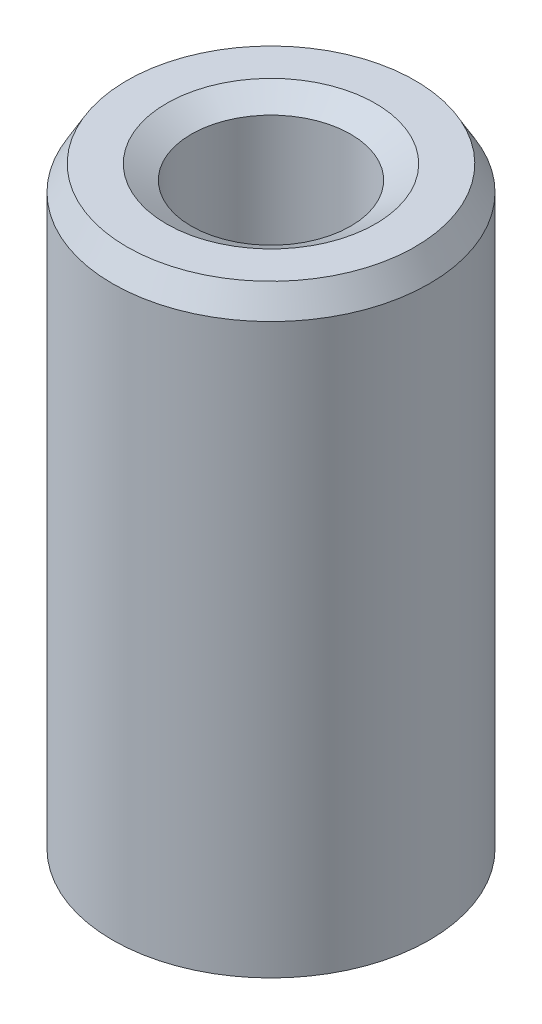
ISO-10303-21;
HEADER;
FILE_DESCRIPTION(('STEP AP214'),'2;1');
FILE_NAME('part.step','',(''),(''),'','','');
FILE_SCHEMA(('AUTOMOTIVE_DESIGN { 1 0 10303 214 1 1 1 1 }'));
ENDSEC;
DATA;
#1=APPLICATION_CONTEXT('core data for automotive mechanical design processes');
#2=APPLICATION_PROTOCOL_DEFINITION('international standard','automotive_design',2000,#1);
#3=PRODUCT_CONTEXT('',#1,'mechanical');
#4=PRODUCT('Part','Part','',(#3));
#5=PRODUCT_RELATED_PRODUCT_CATEGORY('part','',(#4));
#6=PRODUCT_DEFINITION_FORMATION('','',#4);
#7=PRODUCT_DEFINITION_CONTEXT('part definition',#1,'design');
#8=PRODUCT_DEFINITION('design','',#6,#7);
#9=PRODUCT_DEFINITION_SHAPE('','',#8);
#10=(LENGTH_UNIT() NAMED_UNIT(*) SI_UNIT(.MILLI.,.METRE.));
#11=(NAMED_UNIT(*) PLANE_ANGLE_UNIT() SI_UNIT($,.RADIAN.));
#12=(NAMED_UNIT(*) SI_UNIT($,.STERADIAN.) SOLID_ANGLE_UNIT());
#13=UNCERTAINTY_MEASURE_WITH_UNIT(LENGTH_MEASURE(1.E-05),#10,'distance_accuracy_value','');
#14=(GEOMETRIC_REPRESENTATION_CONTEXT(3) GLOBAL_UNCERTAINTY_ASSIGNED_CONTEXT((#13)) GLOBAL_UNIT_ASSIGNED_CONTEXT((#10,
#11,#12)) REPRESENTATION_CONTEXT('',''));
#15=CARTESIAN_POINT('',(0.,0.,0.));
#16=DIRECTION('',(0.,0.,1.));
#17=DIRECTION('',(1.,0.,0.));
#18=AXIS2_PLACEMENT_3D('',#15,#16,#17);
#19=CARTESIAN_POINT('',(0.,95.8757258704667,0.));
#20=DIRECTION('',(0.,-1.,0.));
#21=DIRECTION('',(0.,0.,-1.));
#22=AXIS2_PLACEMENT_3D('',#19,#20,#21);
#23=CYLINDRICAL_SURFACE('',#22,25.);
#24=CARTESIAN_POINT('',(0.,2.25652212274587,0.));
#25=DIRECTION('',(0.,1.,0.));
#26=DIRECTION('',(0.,0.,1.));
#27=AXIS2_PLACEMENT_3D('',#24,#25,#26);
#28=CIRCLE('',#27,25.);
#29=CARTESIAN_POINT('',(0.,2.25652212274587,25.));
#30=VERTEX_POINT('',#29);
#31=EDGE_CURVE('E10',#30,#30,#28,.T.);
#32=ORIENTED_EDGE('',*,*,#31,.T.);
#33=EDGE_LOOP('',(#32));
#34=FACE_BOUND('',#33,.T.);
#35=CARTESIAN_POINT('',(0.,91.9673149054676,0.));
#36=DIRECTION('',(0.,1.,0.));
#37=DIRECTION('',(0.,0.,1.));
#38=AXIS2_PLACEMENT_3D('',#35,#36,#37);
#39=CIRCLE('',#38,25.);
#40=CARTESIAN_POINT('',(0.,91.9673149054676,25.));
#41=VERTEX_POINT('',#40);
#42=EDGE_CURVE('E50',#41,#41,#39,.F.);
#43=ORIENTED_EDGE('',*,*,#42,.T.);
#44=EDGE_LOOP('',(#43));
#45=FACE_BOUND('',#44,.T.);
#46=ADVANCED_FACE('F39',(#34,#45),#23,.T.);
#47=CARTESIAN_POINT('',(0.,95.8757258704667,0.));
#48=DIRECTION('',(0.,1.,0.));
#49=DIRECTION('',(0.,0.,1.));
#50=AXIS2_PLACEMENT_3D('',#47,#48,#49);
#51=PLANE('',#50);
#52=CARTESIAN_POINT('',(0.,95.8757258704667,0.));
#53=DIRECTION('',(0.,1.,0.));
#54=DIRECTION('',(0.,0.,1.));
#55=AXIS2_PLACEMENT_3D('',#52,#53,#54);
#56=CIRCLE('',#55,16.4866349537845);
#57=CARTESIAN_POINT('',(0.,95.8757258704667,16.4866349537845));
#58=VERTEX_POINT('',#57);
#59=EDGE_CURVE('E58',#58,#58,#56,.F.);
#60=ORIENTED_EDGE('',*,*,#59,.T.);
#61=EDGE_LOOP('',(#60));
#62=FACE_BOUND('',#61,.T.);
#63=CARTESIAN_POINT('',(0.,95.8757258704667,0.));
#64=DIRECTION('',(0.,1.,0.));
#65=DIRECTION('',(0.,0.,1.));
#66=AXIS2_PLACEMENT_3D('',#63,#64,#65);
#67=CIRCLE('',#66,22.7434778772541);
#68=CARTESIAN_POINT('',(0.,95.8757258704667,22.7434778772541));
#69=VERTEX_POINT('',#68);
#70=EDGE_CURVE('E61',#69,#69,#67,.T.);
#71=ORIENTED_EDGE('',*,*,#70,.T.);
#72=EDGE_LOOP('',(#71));
#73=FACE_BOUND('',#72,.T.);
#74=ADVANCED_FACE('F88',(#62,#73),#51,.T.);
#75=CARTESIAN_POINT('',(0.,0.,0.));
#76=DIRECTION('',(0.,1.,0.));
#77=DIRECTION('',(0.,0.,1.));
#78=AXIS2_PLACEMENT_3D('',#75,#76,#77);
#79=PLANE('',#78);
#80=CARTESIAN_POINT('',(0.,0.,0.));
#81=DIRECTION('',(0.,1.,0.));
#82=DIRECTION('',(0.,0.,1.));
#83=AXIS2_PLACEMENT_3D('',#80,#81,#82);
#84=CIRCLE('',#83,14.8347461115313);
#85=CARTESIAN_POINT('',(0.,0.,14.8347461115313));
#86=VERTEX_POINT('',#85);
#87=EDGE_CURVE('E51',#86,#86,#84,.T.);
#88=ORIENTED_EDGE('',*,*,#87,.T.);
#89=EDGE_LOOP('',(#88));
#90=FACE_BOUND('',#89,.T.);
#91=CARTESIAN_POINT('',(0.,0.,0.));
#92=DIRECTION('',(0.,1.,0.));
#93=DIRECTION('',(0.,0.,1.));
#94=AXIS2_PLACEMENT_3D('',#91,#92,#93);
#95=CIRCLE('',#94,21.091589035001);
#96=CARTESIAN_POINT('',(0.,0.,21.091589035001));
#97=VERTEX_POINT('',#96);
#98=EDGE_CURVE('E54',#97,#97,#95,.F.);
#99=ORIENTED_EDGE('',*,*,#98,.T.);
#100=EDGE_LOOP('',(#99));
#101=FACE_BOUND('',#100,.T.);
#102=ADVANCED_FACE('F83',(#90,#101),#79,.F.);
#103=CARTESIAN_POINT('',(0.,95.8757258704667,0.));
#104=DIRECTION('',(0.,-1.,0.));
#105=DIRECTION('',(0.,0.,-1.));
#106=AXIS2_PLACEMENT_3D('',#103,#104,#105);
#107=CYLINDRICAL_SURFACE('',#106,12.5782239887855);
#108=CARTESIAN_POINT('',(0.,93.6192037477208,0.));
#109=DIRECTION('',(0.,1.,0.));
#110=DIRECTION('',(0.,0.,1.));
#111=AXIS2_PLACEMENT_3D('',#108,#109,#110);
#112=CIRCLE('',#111,12.5782239887855);
#113=CARTESIAN_POINT('',(0.,93.6192037477208,12.5782239887855));
#114=VERTEX_POINT('',#113);
#115=EDGE_CURVE('E67',#114,#114,#112,.T.);
#116=ORIENTED_EDGE('',*,*,#115,.T.);
#117=EDGE_LOOP('',(#116));
#118=FACE_BOUND('',#117,.T.);
#119=CARTESIAN_POINT('',(0.,3.90841096499903,0.));
#120=DIRECTION('',(0.,1.,0.));
#121=DIRECTION('',(0.,0.,1.));
#122=AXIS2_PLACEMENT_3D('',#119,#120,#121);
#123=CIRCLE('',#122,12.5782239887855);
#124=CARTESIAN_POINT('',(0.,3.90841096499903,12.5782239887855));
#125=VERTEX_POINT('',#124);
#126=EDGE_CURVE('E69',#125,#125,#123,.F.);
#127=ORIENTED_EDGE('',*,*,#126,.T.);
#128=EDGE_LOOP('',(#127));
#129=FACE_BOUND('',#128,.T.);
#130=ADVANCED_FACE('F71',(#118,#129),#107,.F.);
#131=CARTESIAN_POINT('',(0.,93.6192037477208,0.));
#132=DIRECTION('',(0.,1.,0.));
#133=DIRECTION('',(0.,0.,1.));
#134=AXIS2_PLACEMENT_3D('',#131,#132,#133);
#135=CONICAL_SURFACE('',#134,12.5782239887855,1.0471975511966);
#136=ORIENTED_EDGE('',*,*,#59,.F.);
#137=EDGE_LOOP('',(#136));
#138=FACE_BOUND('',#137,.T.);
#139=ORIENTED_EDGE('',*,*,#115,.F.);
#140=EDGE_LOOP('',(#139));
#141=FACE_BOUND('',#140,.T.);
#142=ADVANCED_FACE('F77',(#138,#141),#135,.F.);
#143=CARTESIAN_POINT('',(0.,0.,0.));
#144=DIRECTION('',(0.,-1.,0.));
#145=DIRECTION('',(0.,0.,-1.));
#146=AXIS2_PLACEMENT_3D('',#143,#144,#145);
#147=CONICAL_SURFACE('',#146,14.8347461115313,0.523598775598298);
#148=ORIENTED_EDGE('',*,*,#126,.F.);
#149=EDGE_LOOP('',(#148));
#150=FACE_BOUND('',#149,.T.);
#151=ORIENTED_EDGE('',*,*,#87,.F.);
#152=EDGE_LOOP('',(#151));
#153=FACE_BOUND('',#152,.T.);
#154=ADVANCED_FACE('F73',(#150,#153),#147,.F.);
#155=CARTESIAN_POINT('',(0.,2.25652212274587,0.));
#156=DIRECTION('',(0.,1.,0.));
#157=DIRECTION('',(0.,0.,1.));
#158=AXIS2_PLACEMENT_3D('',#155,#156,#157);
#159=CONICAL_SURFACE('',#158,25.,1.0471975511966);
#160=ORIENTED_EDGE('',*,*,#98,.F.);
#161=EDGE_LOOP('',(#160));
#162=FACE_BOUND('',#161,.T.);
#163=ORIENTED_EDGE('',*,*,#31,.F.);
#164=EDGE_LOOP('',(#163));
#165=FACE_BOUND('',#164,.T.);
#166=ADVANCED_FACE('F76',(#162,#165),#159,.T.);
#167=CARTESIAN_POINT('',(0.,95.8757258704667,0.));
#168=DIRECTION('',(0.,-1.,0.));
#169=DIRECTION('',(0.,0.,-1.));
#170=AXIS2_PLACEMENT_3D('',#167,#168,#169);
#171=CONICAL_SURFACE('',#170,22.7434778772541,0.523598775598292);
#172=ORIENTED_EDGE('',*,*,#42,.F.);
#173=EDGE_LOOP('',(#172));
#174=FACE_BOUND('',#173,.T.);
#175=ORIENTED_EDGE('',*,*,#70,.F.);
#176=EDGE_LOOP('',(#175));
#177=FACE_BOUND('',#176,.T.);
#178=ADVANCED_FACE('F45',(#174,#177),#171,.T.);
#179=CLOSED_SHELL('',(#46,#74,#102,#130,#142,#154,#166,#178));
#180=MANIFOLD_SOLID_BREP('B2',#179);
#181=ADVANCED_BREP_SHAPE_REPRESENTATION('',(#18,#180),#14);
#182=SHAPE_DEFINITION_REPRESENTATION(#9,#181);
ENDSEC;
END-ISO-10303-21;
